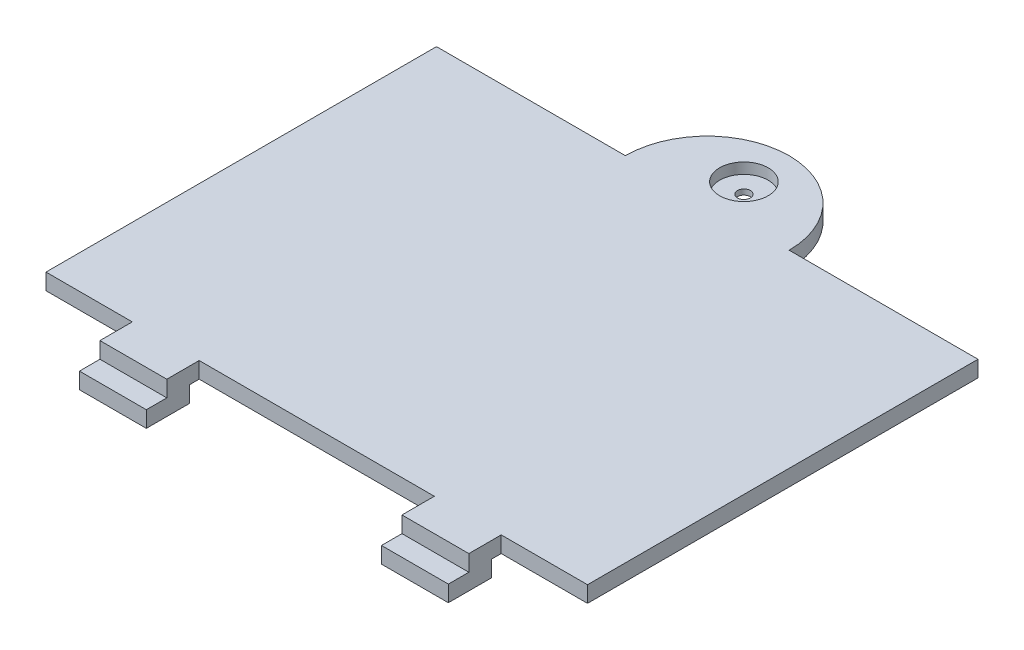
ISO-10303-21;
HEADER;
FILE_DESCRIPTION(('STEP AP214'),'2;1');
FILE_NAME('part.step','',(''),(''),'','','');
FILE_SCHEMA(('AUTOMOTIVE_DESIGN { 1 0 10303 214 1 1 1 1 }'));
ENDSEC;
DATA;
#1=APPLICATION_CONTEXT('core data for automotive mechanical design processes');
#2=APPLICATION_PROTOCOL_DEFINITION('international standard','automotive_design',2000,#1);
#3=PRODUCT_CONTEXT('',#1,'mechanical');
#4=PRODUCT('Part','Part','',(#3));
#5=PRODUCT_RELATED_PRODUCT_CATEGORY('part','',(#4));
#6=PRODUCT_DEFINITION_FORMATION('','',#4);
#7=PRODUCT_DEFINITION_CONTEXT('part definition',#1,'design');
#8=PRODUCT_DEFINITION('design','',#6,#7);
#9=PRODUCT_DEFINITION_SHAPE('','',#8);
#10=(LENGTH_UNIT() NAMED_UNIT(*) SI_UNIT(.MILLI.,.METRE.));
#11=(NAMED_UNIT(*) PLANE_ANGLE_UNIT() SI_UNIT($,.RADIAN.));
#12=(NAMED_UNIT(*) SI_UNIT($,.STERADIAN.) SOLID_ANGLE_UNIT());
#13=UNCERTAINTY_MEASURE_WITH_UNIT(LENGTH_MEASURE(1.E-05),#10,'distance_accuracy_value','');
#14=(GEOMETRIC_REPRESENTATION_CONTEXT(3) GLOBAL_UNCERTAINTY_ASSIGNED_CONTEXT((#13)) GLOBAL_UNIT_ASSIGNED_CONTEXT((#10,
#11,#12)) REPRESENTATION_CONTEXT('',''));
#15=CARTESIAN_POINT('',(0.,0.,0.));
#16=DIRECTION('',(0.,0.,1.));
#17=DIRECTION('',(1.,0.,0.));
#18=AXIS2_PLACEMENT_3D('',#15,#16,#17);
#19=CARTESIAN_POINT('',(0.,0.,0.));
#20=DIRECTION('',(0.,-1.,0.));
#21=DIRECTION('',(0.,0.,-1.));
#22=AXIS2_PLACEMENT_3D('',#19,#20,#21);
#23=PLANE('',#22);
#24=CARTESIAN_POINT('',(-25.1,0.,-3.4));
#25=DIRECTION('',(0.,-1.,0.));
#26=DIRECTION('',(0.,0.,-1.));
#27=AXIS2_PLACEMENT_3D('',#24,#25,#26);
#28=CIRCLE('',#27,0.6);
#29=CARTESIAN_POINT('',(-25.1,0.,-3.99999999999999));
#30=VERTEX_POINT('',#29);
#31=EDGE_CURVE('E46',#30,#30,#28,.T.);
#32=ORIENTED_EDGE('',*,*,#31,.F.);
#33=EDGE_LOOP('',(#32));
#34=FACE_BOUND('',#33,.T.);
#35=DIRECTION('',(0.,0.,-1.));
#36=VECTOR('',#35,1.);
#37=CARTESIAN_POINT('',(-7.99999999999999,0.,39.2));
#38=LINE('',#37,#36);
#39=CARTESIAN_POINT('',(-7.99999999999999,0.,37.1));
#40=VERTEX_POINT('',#39);
#41=CARTESIAN_POINT('',(-7.99999999999999,0.,36.2));
#42=VERTEX_POINT('',#41);
#43=EDGE_CURVE('E209',#40,#42,#38,.T.);
#44=ORIENTED_EDGE('',*,*,#43,.F.);
#45=DIRECTION('',(1.,0.,0.));
#46=VECTOR('',#45,1.);
#47=CARTESIAN_POINT('',(-7.99999999999999,0.,37.1));
#48=LINE('',#47,#46);
#49=CARTESIAN_POINT('',(-14.2,0.,37.1));
#50=VERTEX_POINT('',#49);
#51=EDGE_CURVE('E193',#50,#40,#48,.T.);
#52=ORIENTED_EDGE('',*,*,#51,.F.);
#53=DIRECTION('',(0.,0.,-1.));
#54=VECTOR('',#53,1.);
#55=CARTESIAN_POINT('',(-14.2,0.,39.2));
#56=LINE('',#55,#54);
#57=CARTESIAN_POINT('',(-14.2,0.,36.2));
#58=VERTEX_POINT('',#57);
#59=EDGE_CURVE('E219',#50,#58,#56,.T.);
#60=ORIENTED_EDGE('',*,*,#59,.T.);
#61=DIRECTION('',(1.,0.,0.));
#62=VECTOR('',#61,1.);
#63=CARTESIAN_POINT('',(0.,0.,36.2));
#64=LINE('',#63,#62);
#65=CARTESIAN_POINT('',(-36.,0.,36.2));
#66=VERTEX_POINT('',#65);
#67=EDGE_CURVE('E294',#66,#58,#64,.T.);
#68=ORIENTED_EDGE('',*,*,#67,.F.);
#69=DIRECTION('',(0.,0.,-1.));
#70=VECTOR('',#69,1.);
#71=CARTESIAN_POINT('',(-36.,0.,39.2));
#72=LINE('',#71,#70);
#73=CARTESIAN_POINT('',(-36.,0.,37.1));
#74=VERTEX_POINT('',#73);
#75=EDGE_CURVE('E265',#74,#66,#72,.T.);
#76=ORIENTED_EDGE('',*,*,#75,.F.);
#77=DIRECTION('',(1.,0.,0.));
#78=VECTOR('',#77,1.);
#79=CARTESIAN_POINT('',(-36.,0.,37.1));
#80=LINE('',#79,#78);
#81=CARTESIAN_POINT('',(-42.2,0.,37.1));
#82=VERTEX_POINT('',#81);
#83=EDGE_CURVE('E58',#82,#74,#80,.T.);
#84=ORIENTED_EDGE('',*,*,#83,.F.);
#85=DIRECTION('',(0.,0.,-1.));
#86=VECTOR('',#85,1.);
#87=CARTESIAN_POINT('',(-42.2,0.,39.2));
#88=LINE('',#87,#86);
#89=CARTESIAN_POINT('',(-42.2,0.,36.2));
#90=VERTEX_POINT('',#89);
#91=EDGE_CURVE('E267',#82,#90,#88,.T.);
#92=ORIENTED_EDGE('',*,*,#91,.T.);
#93=CARTESIAN_POINT('',(-50.2,0.,36.2));
#94=VERTEX_POINT('',#93);
#95=EDGE_CURVE('E273',#94,#90,#64,.T.);
#96=ORIENTED_EDGE('',*,*,#95,.F.);
#97=DIRECTION('',(0.,0.,1.));
#98=VECTOR('',#97,1.);
#99=CARTESIAN_POINT('',(-50.2,0.,0.));
#100=LINE('',#99,#98);
#101=CARTESIAN_POINT('',(-50.2,0.,0.));
#102=VERTEX_POINT('',#101);
#103=EDGE_CURVE('E290',#102,#94,#100,.T.);
#104=ORIENTED_EDGE('',*,*,#103,.F.);
#105=DIRECTION('',(-1.,0.,0.));
#106=VECTOR('',#105,1.);
#107=CARTESIAN_POINT('',(0.,0.,0.));
#108=LINE('',#107,#106);
#109=CARTESIAN_POINT('',(-32.69,0.,0.));
#110=VERTEX_POINT('',#109);
#111=EDGE_CURVE('E287',#110,#102,#108,.T.);
#112=ORIENTED_EDGE('',*,*,#111,.F.);
#113=CARTESIAN_POINT('',(-25.1,0.,0.));
#114=DIRECTION('',(0.,1.,0.));
#115=DIRECTION('',(0.,0.,1.));
#116=AXIS2_PLACEMENT_3D('',#113,#114,#115);
#117=CIRCLE('',#116,7.59);
#118=CARTESIAN_POINT('',(-17.51,0.,0.));
#119=VERTEX_POINT('',#118);
#120=EDGE_CURVE('E326',#110,#119,#117,.F.);
#121=ORIENTED_EDGE('',*,*,#120,.T.);
#122=CARTESIAN_POINT('',(0.,0.,0.));
#123=VERTEX_POINT('',#122);
#124=EDGE_CURVE('E288',#123,#119,#108,.T.);
#125=ORIENTED_EDGE('',*,*,#124,.F.);
#126=DIRECTION('',(0.,0.,-1.));
#127=VECTOR('',#126,1.);
#128=CARTESIAN_POINT('',(0.,0.,0.));
#129=LINE('',#128,#127);
#130=CARTESIAN_POINT('',(0.,0.,36.2));
#131=VERTEX_POINT('',#130);
#132=EDGE_CURVE('E269',#131,#123,#129,.T.);
#133=ORIENTED_EDGE('',*,*,#132,.F.);
#134=EDGE_CURVE('E216',#42,#131,#64,.T.);
#135=ORIENTED_EDGE('',*,*,#134,.F.);
#136=EDGE_LOOP('',(#44,#52,#60,#68,#76,#84,#92,#96,#104,#112,#121,#125,#133,#135));
#137=FACE_BOUND('',#136,.T.);
#138=ADVANCED_FACE('F42',(#34,#137),#23,.T.);
#139=CARTESIAN_POINT('',(0.,1.5,0.));
#140=DIRECTION('',(0.,0.,1.));
#141=DIRECTION('',(1.,0.,0.));
#142=AXIS2_PLACEMENT_3D('',#139,#140,#141);
#143=PLANE('',#142);
#144=DIRECTION('',(0.,1.,0.));
#145=VECTOR('',#144,1.);
#146=CARTESIAN_POINT('',(-17.51,0.,0.));
#147=LINE('',#146,#145);
#148=CARTESIAN_POINT('',(-17.51,1.5,0.));
#149=VERTEX_POINT('',#148);
#150=EDGE_CURVE('E224',#119,#149,#147,.T.);
#151=ORIENTED_EDGE('',*,*,#150,.T.);
#152=DIRECTION('',(-1.,0.,0.));
#153=VECTOR('',#152,1.);
#154=CARTESIAN_POINT('',(0.,1.5,0.));
#155=LINE('',#154,#153);
#156=CARTESIAN_POINT('',(0.,1.5,0.));
#157=VERTEX_POINT('',#156);
#158=EDGE_CURVE('E274',#157,#149,#155,.T.);
#159=ORIENTED_EDGE('',*,*,#158,.F.);
#160=DIRECTION('',(0.,-1.,0.));
#161=VECTOR('',#160,1.);
#162=CARTESIAN_POINT('',(0.,1.5,0.));
#163=LINE('',#162,#161);
#164=EDGE_CURVE('E11',#157,#123,#163,.T.);
#165=ORIENTED_EDGE('',*,*,#164,.T.);
#166=ORIENTED_EDGE('',*,*,#124,.T.);
#167=EDGE_LOOP('',(#151,#159,#165,#166));
#168=FACE_BOUND('',#167,.T.);
#169=ADVANCED_FACE('F341',(#168),#143,.F.);
#170=DIRECTION('',(0.,1.,0.));
#171=VECTOR('',#170,1.);
#172=CARTESIAN_POINT('',(-32.69,0.,0.));
#173=LINE('',#172,#171);
#174=CARTESIAN_POINT('',(-32.69,1.5,0.));
#175=VERTEX_POINT('',#174);
#176=EDGE_CURVE('E329',#110,#175,#173,.T.);
#177=ORIENTED_EDGE('',*,*,#176,.F.);
#178=ORIENTED_EDGE('',*,*,#111,.T.);
#179=DIRECTION('',(0.,-1.,0.));
#180=VECTOR('',#179,1.);
#181=CARTESIAN_POINT('',(-50.2,1.5,0.));
#182=LINE('',#181,#180);
#183=CARTESIAN_POINT('',(-50.2,1.5,0.));
#184=VERTEX_POINT('',#183);
#185=EDGE_CURVE('E51',#184,#102,#182,.T.);
#186=ORIENTED_EDGE('',*,*,#185,.F.);
#187=EDGE_CURVE('E66',#175,#184,#155,.T.);
#188=ORIENTED_EDGE('',*,*,#187,.F.);
#189=EDGE_LOOP('',(#177,#178,#186,#188));
#190=FACE_BOUND('',#189,.T.);
#191=ADVANCED_FACE('F338',(#190),#143,.F.);
#192=CARTESIAN_POINT('',(0.,1.5,36.2));
#193=DIRECTION('',(0.,0.,-1.));
#194=DIRECTION('',(-1.,0.,0.));
#195=AXIS2_PLACEMENT_3D('',#192,#193,#194);
#196=PLANE('',#195);
#197=DIRECTION('',(0.,-1.,0.));
#198=VECTOR('',#197,1.);
#199=CARTESIAN_POINT('',(-14.2,0.,36.2));
#200=LINE('',#199,#198);
#201=CARTESIAN_POINT('',(-14.2,1.5,36.2));
#202=VERTEX_POINT('',#201);
#203=EDGE_CURVE('E233',#202,#58,#200,.T.);
#204=ORIENTED_EDGE('',*,*,#203,.F.);
#205=DIRECTION('',(1.,0.,0.));
#206=VECTOR('',#205,1.);
#207=CARTESIAN_POINT('',(0.,1.5,36.2));
#208=LINE('',#207,#206);
#209=CARTESIAN_POINT('',(-36.,1.5,36.2));
#210=VERTEX_POINT('',#209);
#211=EDGE_CURVE('E284',#210,#202,#208,.T.);
#212=ORIENTED_EDGE('',*,*,#211,.F.);
#213=DIRECTION('',(0.,1.,0.));
#214=VECTOR('',#213,1.);
#215=CARTESIAN_POINT('',(-36.,0.,36.2));
#216=LINE('',#215,#214);
#217=EDGE_CURVE('E249',#66,#210,#216,.T.);
#218=ORIENTED_EDGE('',*,*,#217,.F.);
#219=ORIENTED_EDGE('',*,*,#67,.T.);
#220=EDGE_LOOP('',(#204,#212,#218,#219));
#221=FACE_BOUND('',#220,.T.);
#222=ADVANCED_FACE('F340',(#221),#196,.F.);
#223=DIRECTION('',(0.,1.,0.));
#224=VECTOR('',#223,1.);
#225=CARTESIAN_POINT('',(-7.99999999999999,0.,36.2));
#226=LINE('',#225,#224);
#227=CARTESIAN_POINT('',(-7.99999999999999,1.5,36.2));
#228=VERTEX_POINT('',#227);
#229=EDGE_CURVE('E231',#42,#228,#226,.T.);
#230=ORIENTED_EDGE('',*,*,#229,.F.);
#231=ORIENTED_EDGE('',*,*,#134,.T.);
#232=DIRECTION('',(0.,-1.,0.));
#233=VECTOR('',#232,1.);
#234=CARTESIAN_POINT('',(0.,1.5,36.2));
#235=LINE('',#234,#233);
#236=CARTESIAN_POINT('',(0.,1.5,36.2));
#237=VERTEX_POINT('',#236);
#238=EDGE_CURVE('E283',#237,#131,#235,.T.);
#239=ORIENTED_EDGE('',*,*,#238,.F.);
#240=EDGE_CURVE('E279',#228,#237,#208,.T.);
#241=ORIENTED_EDGE('',*,*,#240,.F.);
#242=EDGE_LOOP('',(#230,#231,#239,#241));
#243=FACE_BOUND('',#242,.T.);
#244=ADVANCED_FACE('F346',(#243),#196,.F.);
#245=DIRECTION('',(0.,-1.,0.));
#246=VECTOR('',#245,1.);
#247=CARTESIAN_POINT('',(-42.2,0.,36.2));
#248=LINE('',#247,#246);
#249=CARTESIAN_POINT('',(-42.2,1.5,36.2));
#250=VERTEX_POINT('',#249);
#251=EDGE_CURVE('E237',#250,#90,#248,.T.);
#252=ORIENTED_EDGE('',*,*,#251,.F.);
#253=CARTESIAN_POINT('',(-50.2,1.5,36.2));
#254=VERTEX_POINT('',#253);
#255=EDGE_CURVE('E280',#254,#250,#208,.T.);
#256=ORIENTED_EDGE('',*,*,#255,.F.);
#257=DIRECTION('',(0.,-1.,0.));
#258=VECTOR('',#257,1.);
#259=CARTESIAN_POINT('',(-50.2,1.5,36.2));
#260=LINE('',#259,#258);
#261=EDGE_CURVE('E297',#254,#94,#260,.T.);
#262=ORIENTED_EDGE('',*,*,#261,.T.);
#263=ORIENTED_EDGE('',*,*,#95,.T.);
#264=EDGE_LOOP('',(#252,#256,#262,#263));
#265=FACE_BOUND('',#264,.T.);
#266=ADVANCED_FACE('F309',(#265),#196,.F.);
#267=CARTESIAN_POINT('',(0.,1.5,0.));
#268=DIRECTION('',(-1.,0.,0.));
#269=DIRECTION('',(0.,0.,1.));
#270=AXIS2_PLACEMENT_3D('',#267,#268,#269);
#271=PLANE('',#270);
#272=ORIENTED_EDGE('',*,*,#132,.T.);
#273=ORIENTED_EDGE('',*,*,#164,.F.);
#274=DIRECTION('',(0.,0.,-1.));
#275=VECTOR('',#274,1.);
#276=CARTESIAN_POINT('',(0.,1.5,0.));
#277=LINE('',#276,#275);
#278=EDGE_CURVE('E270',#237,#157,#277,.T.);
#279=ORIENTED_EDGE('',*,*,#278,.F.);
#280=ORIENTED_EDGE('',*,*,#238,.T.);
#281=EDGE_LOOP('',(#272,#273,#279,#280));
#282=FACE_BOUND('',#281,.T.);
#283=ADVANCED_FACE('F44',(#282),#271,.F.);
#284=CARTESIAN_POINT('',(-50.2,1.5,0.));
#285=DIRECTION('',(1.,0.,0.));
#286=DIRECTION('',(0.,0.,-1.));
#287=AXIS2_PLACEMENT_3D('',#284,#285,#286);
#288=PLANE('',#287);
#289=ORIENTED_EDGE('',*,*,#103,.T.);
#290=ORIENTED_EDGE('',*,*,#261,.F.);
#291=DIRECTION('',(0.,0.,1.));
#292=VECTOR('',#291,1.);
#293=CARTESIAN_POINT('',(-50.2,1.5,0.));
#294=LINE('',#293,#292);
#295=EDGE_CURVE('E277',#184,#254,#294,.T.);
#296=ORIENTED_EDGE('',*,*,#295,.F.);
#297=ORIENTED_EDGE('',*,*,#185,.T.);
#298=EDGE_LOOP('',(#289,#290,#296,#297));
#299=FACE_BOUND('',#298,.T.);
#300=ADVANCED_FACE('F304',(#299),#288,.F.);
#301=CARTESIAN_POINT('',(0.,1.5,0.));
#302=DIRECTION('',(0.,-1.,0.));
#303=DIRECTION('',(0.,0.,-1.));
#304=AXIS2_PLACEMENT_3D('',#301,#302,#303);
#305=PLANE('',#304);
#306=CARTESIAN_POINT('',(-25.1,1.5,-3.4));
#307=DIRECTION('',(0.,1.,0.));
#308=DIRECTION('',(0.,0.,1.));
#309=AXIS2_PLACEMENT_3D('',#306,#307,#308);
#310=CIRCLE('',#309,2.25);
#311=CARTESIAN_POINT('',(-25.1,1.5,-1.15));
#312=VERTEX_POINT('',#311);
#313=EDGE_CURVE('E332',#312,#312,#310,.T.);
#314=ORIENTED_EDGE('',*,*,#313,.F.);
#315=EDGE_LOOP('',(#314));
#316=FACE_BOUND('',#315,.T.);
#317=ORIENTED_EDGE('',*,*,#278,.T.);
#318=ORIENTED_EDGE('',*,*,#158,.T.);
#319=CARTESIAN_POINT('',(-25.1,1.5,0.));
#320=DIRECTION('',(0.,1.,0.));
#321=DIRECTION('',(0.,0.,1.));
#322=AXIS2_PLACEMENT_3D('',#319,#320,#321);
#323=CIRCLE('',#322,7.59);
#324=EDGE_CURVE('E323',#175,#149,#323,.F.);
#325=ORIENTED_EDGE('',*,*,#324,.F.);
#326=ORIENTED_EDGE('',*,*,#187,.T.);
#327=ORIENTED_EDGE('',*,*,#295,.T.);
#328=ORIENTED_EDGE('',*,*,#255,.T.);
#329=DIRECTION('',(0.,0.,-1.));
#330=VECTOR('',#329,1.);
#331=CARTESIAN_POINT('',(-42.2,1.5,39.2));
#332=LINE('',#331,#330);
#333=CARTESIAN_POINT('',(-42.2,1.5,39.2));
#334=VERTEX_POINT('',#333);
#335=EDGE_CURVE('E255',#334,#250,#332,.T.);
#336=ORIENTED_EDGE('',*,*,#335,.F.);
#337=DIRECTION('',(-1.,0.,0.));
#338=VECTOR('',#337,1.);
#339=CARTESIAN_POINT('',(-42.2,1.5,39.2));
#340=LINE('',#339,#338);
#341=CARTESIAN_POINT('',(-36.,1.5,39.2));
#342=VERTEX_POINT('',#341);
#343=EDGE_CURVE('E253',#342,#334,#340,.T.);
#344=ORIENTED_EDGE('',*,*,#343,.F.);
#345=DIRECTION('',(0.,0.,-1.));
#346=VECTOR('',#345,1.);
#347=CARTESIAN_POINT('',(-36.,1.5,39.2));
#348=LINE('',#347,#346);
#349=EDGE_CURVE('E262',#342,#210,#348,.T.);
#350=ORIENTED_EDGE('',*,*,#349,.T.);
#351=ORIENTED_EDGE('',*,*,#211,.T.);
#352=DIRECTION('',(0.,0.,-1.));
#353=VECTOR('',#352,1.);
#354=CARTESIAN_POINT('',(-14.2,1.5,39.2));
#355=LINE('',#354,#353);
#356=CARTESIAN_POINT('',(-14.2,1.5,39.2));
#357=VERTEX_POINT('',#356);
#358=EDGE_CURVE('E222',#357,#202,#355,.T.);
#359=ORIENTED_EDGE('',*,*,#358,.F.);
#360=DIRECTION('',(-1.,0.,0.));
#361=VECTOR('',#360,1.);
#362=CARTESIAN_POINT('',(-14.2,1.5,39.2));
#363=LINE('',#362,#361);
#364=CARTESIAN_POINT('',(-7.99999999999999,1.5,39.2));
#365=VERTEX_POINT('',#364);
#366=EDGE_CURVE('E230',#365,#357,#363,.T.);
#367=ORIENTED_EDGE('',*,*,#366,.F.);
#368=DIRECTION('',(0.,0.,-1.));
#369=VECTOR('',#368,1.);
#370=CARTESIAN_POINT('',(-7.99999999999999,1.5,39.2));
#371=LINE('',#370,#369);
#372=EDGE_CURVE('E218',#365,#228,#371,.T.);
#373=ORIENTED_EDGE('',*,*,#372,.T.);
#374=ORIENTED_EDGE('',*,*,#240,.T.);
#375=EDGE_LOOP('',(#317,#318,#325,#326,#327,#328,#336,#344,#350,#351,#359,#367,#373,#374));
#376=FACE_BOUND('',#375,.T.);
#377=ADVANCED_FACE('F320',(#316,#376),#305,.F.);
#378=CARTESIAN_POINT('',(-42.2,0.,39.2));
#379=DIRECTION('',(1.,0.,0.));
#380=DIRECTION('',(0.,0.,-1.));
#381=AXIS2_PLACEMENT_3D('',#378,#379,#380);
#382=PLANE('',#381);
#383=ORIENTED_EDGE('',*,*,#251,.T.);
#384=ORIENTED_EDGE('',*,*,#91,.F.);
#385=DIRECTION('',(0.,1.,0.));
#386=VECTOR('',#385,1.);
#387=CARTESIAN_POINT('',(-42.2,-1.5,37.1));
#388=LINE('',#387,#386);
#389=CARTESIAN_POINT('',(-42.2,-1.5,37.1));
#390=VERTEX_POINT('',#389);
#391=EDGE_CURVE('E395',#390,#82,#388,.T.);
#392=ORIENTED_EDGE('',*,*,#391,.F.);
#393=DIRECTION('',(0.,0.,-1.));
#394=VECTOR('',#393,1.);
#395=CARTESIAN_POINT('',(-42.2,-1.5,37.1));
#396=LINE('',#395,#394);
#397=CARTESIAN_POINT('',(-42.2,-1.5,41.1));
#398=VERTEX_POINT('',#397);
#399=EDGE_CURVE('E799',#398,#390,#396,.T.);
#400=ORIENTED_EDGE('',*,*,#399,.F.);
#401=DIRECTION('',(0.,1.,0.));
#402=VECTOR('',#401,1.);
#403=CARTESIAN_POINT('',(-42.2,-1.5,41.1));
#404=LINE('',#403,#402);
#405=CARTESIAN_POINT('',(-42.2,0.,41.1));
#406=VERTEX_POINT('',#405);
#407=EDGE_CURVE('E409',#398,#406,#404,.T.);
#408=ORIENTED_EDGE('',*,*,#407,.T.);
#409=DIRECTION('',(0.,0.,-1.));
#410=VECTOR('',#409,1.);
#411=CARTESIAN_POINT('',(-42.2,0.,37.1));
#412=LINE('',#411,#410);
#413=CARTESIAN_POINT('',(-42.2,0.,39.2));
#414=VERTEX_POINT('',#413);
#415=EDGE_CURVE('E397',#406,#414,#412,.T.);
#416=ORIENTED_EDGE('',*,*,#415,.T.);
#417=DIRECTION('',(0.,-1.,0.));
#418=VECTOR('',#417,1.);
#419=CARTESIAN_POINT('',(-42.2,0.,39.2));
#420=LINE('',#419,#418);
#421=EDGE_CURVE('E246',#334,#414,#420,.T.);
#422=ORIENTED_EDGE('',*,*,#421,.F.);
#423=ORIENTED_EDGE('',*,*,#335,.T.);
#424=EDGE_LOOP('',(#383,#384,#392,#400,#408,#416,#422,#423));
#425=FACE_BOUND('',#424,.T.);
#426=ADVANCED_FACE('F312',(#425),#382,.F.);
#427=CARTESIAN_POINT('',(-36.,0.,39.2));
#428=DIRECTION('',(-1.,0.,0.));
#429=DIRECTION('',(0.,-1.,0.));
#430=AXIS2_PLACEMENT_3D('',#427,#428,#429);
#431=PLANE('',#430);
#432=ORIENTED_EDGE('',*,*,#217,.T.);
#433=ORIENTED_EDGE('',*,*,#349,.F.);
#434=DIRECTION('',(0.,1.,0.));
#435=VECTOR('',#434,1.);
#436=CARTESIAN_POINT('',(-36.,0.,39.2));
#437=LINE('',#436,#435);
#438=CARTESIAN_POINT('',(-36.,0.,39.2));
#439=VERTEX_POINT('',#438);
#440=EDGE_CURVE('E251',#439,#342,#437,.T.);
#441=ORIENTED_EDGE('',*,*,#440,.F.);
#442=DIRECTION('',(0.,0.,1.));
#443=VECTOR('',#442,1.);
#444=CARTESIAN_POINT('',(-36.,0.,37.1));
#445=LINE('',#444,#443);
#446=CARTESIAN_POINT('',(-36.,0.,41.1));
#447=VERTEX_POINT('',#446);
#448=EDGE_CURVE('E793',#439,#447,#445,.T.);
#449=ORIENTED_EDGE('',*,*,#448,.T.);
#450=DIRECTION('',(0.,1.,0.));
#451=VECTOR('',#450,1.);
#452=CARTESIAN_POINT('',(-36.,-1.5,41.1));
#453=LINE('',#452,#451);
#454=CARTESIAN_POINT('',(-36.,-1.5,41.1));
#455=VERTEX_POINT('',#454);
#456=EDGE_CURVE('E412',#455,#447,#453,.T.);
#457=ORIENTED_EDGE('',*,*,#456,.F.);
#458=DIRECTION('',(0.,0.,1.));
#459=VECTOR('',#458,1.);
#460=CARTESIAN_POINT('',(-36.,-1.5,37.1));
#461=LINE('',#460,#459);
#462=CARTESIAN_POINT('',(-36.,-1.5,37.1));
#463=VERTEX_POINT('',#462);
#464=EDGE_CURVE('E396',#463,#455,#461,.T.);
#465=ORIENTED_EDGE('',*,*,#464,.F.);
#466=DIRECTION('',(0.,1.,0.));
#467=VECTOR('',#466,1.);
#468=CARTESIAN_POINT('',(-36.,-1.5,37.1));
#469=LINE('',#468,#467);
#470=EDGE_CURVE('E391',#463,#74,#469,.T.);
#471=ORIENTED_EDGE('',*,*,#470,.T.);
#472=ORIENTED_EDGE('',*,*,#75,.T.);
#473=EDGE_LOOP('',(#432,#433,#441,#449,#457,#465,#471,#472));
#474=FACE_BOUND('',#473,.T.);
#475=ADVANCED_FACE('F386',(#474),#431,.F.);
#476=CARTESIAN_POINT('',(0.,0.,39.2));
#477=DIRECTION('',(0.,0.,-1.));
#478=DIRECTION('',(-1.,0.,0.));
#479=AXIS2_PLACEMENT_3D('',#476,#477,#478);
#480=PLANE('',#479);
#481=ORIENTED_EDGE('',*,*,#421,.T.);
#482=DIRECTION('',(1.,0.,0.));
#483=VECTOR('',#482,1.);
#484=CARTESIAN_POINT('',(-42.2,0.,39.2));
#485=LINE('',#484,#483);
#486=EDGE_CURVE('E248',#414,#439,#485,.T.);
#487=ORIENTED_EDGE('',*,*,#486,.T.);
#488=ORIENTED_EDGE('',*,*,#440,.T.);
#489=ORIENTED_EDGE('',*,*,#343,.T.);
#490=EDGE_LOOP('',(#481,#487,#488,#489));
#491=FACE_BOUND('',#490,.T.);
#492=ADVANCED_FACE('F446',(#491),#480,.F.);
#493=CARTESIAN_POINT('',(-14.2,0.,39.2));
#494=DIRECTION('',(1.,0.,0.));
#495=DIRECTION('',(0.,1.,0.));
#496=AXIS2_PLACEMENT_3D('',#493,#494,#495);
#497=PLANE('',#496);
#498=ORIENTED_EDGE('',*,*,#203,.T.);
#499=ORIENTED_EDGE('',*,*,#59,.F.);
#500=DIRECTION('',(0.,1.,0.));
#501=VECTOR('',#500,1.);
#502=CARTESIAN_POINT('',(-14.2,-1.5,37.1));
#503=LINE('',#502,#501);
#504=CARTESIAN_POINT('',(-14.2,-1.5,37.1));
#505=VERTEX_POINT('',#504);
#506=EDGE_CURVE('E200',#505,#50,#503,.T.);
#507=ORIENTED_EDGE('',*,*,#506,.F.);
#508=DIRECTION('',(0.,0.,-1.));
#509=VECTOR('',#508,1.);
#510=CARTESIAN_POINT('',(-14.2,-1.5,37.1));
#511=LINE('',#510,#509);
#512=CARTESIAN_POINT('',(-14.2,-1.5,41.1));
#513=VERTEX_POINT('',#512);
#514=EDGE_CURVE('E795',#513,#505,#511,.T.);
#515=ORIENTED_EDGE('',*,*,#514,.F.);
#516=DIRECTION('',(0.,1.,0.));
#517=VECTOR('',#516,1.);
#518=CARTESIAN_POINT('',(-14.2,-1.5,41.1));
#519=LINE('',#518,#517);
#520=CARTESIAN_POINT('',(-14.2,0.,41.1));
#521=VERTEX_POINT('',#520);
#522=EDGE_CURVE('E783',#513,#521,#519,.T.);
#523=ORIENTED_EDGE('',*,*,#522,.T.);
#524=DIRECTION('',(0.,0.,-1.));
#525=VECTOR('',#524,1.);
#526=CARTESIAN_POINT('',(-14.2,0.,37.1));
#527=LINE('',#526,#525);
#528=CARTESIAN_POINT('',(-14.2,0.,39.2));
#529=VERTEX_POINT('',#528);
#530=EDGE_CURVE('E203',#521,#529,#527,.T.);
#531=ORIENTED_EDGE('',*,*,#530,.T.);
#532=DIRECTION('',(0.,-1.,0.));
#533=VECTOR('',#532,1.);
#534=CARTESIAN_POINT('',(-14.2,0.,39.2));
#535=LINE('',#534,#533);
#536=EDGE_CURVE('E234',#357,#529,#535,.T.);
#537=ORIENTED_EDGE('',*,*,#536,.F.);
#538=ORIENTED_EDGE('',*,*,#358,.T.);
#539=EDGE_LOOP('',(#498,#499,#507,#515,#523,#531,#537,#538));
#540=FACE_BOUND('',#539,.T.);
#541=ADVANCED_FACE('F380',(#540),#497,.F.);
#542=CARTESIAN_POINT('',(-7.99999999999999,0.,39.2));
#543=DIRECTION('',(-1.,0.,0.));
#544=DIRECTION('',(0.,0.,1.));
#545=AXIS2_PLACEMENT_3D('',#542,#543,#544);
#546=PLANE('',#545);
#547=ORIENTED_EDGE('',*,*,#229,.T.);
#548=ORIENTED_EDGE('',*,*,#372,.F.);
#549=DIRECTION('',(0.,1.,0.));
#550=VECTOR('',#549,1.);
#551=CARTESIAN_POINT('',(-7.99999999999999,0.,39.2));
#552=LINE('',#551,#550);
#553=CARTESIAN_POINT('',(-7.99999999999999,0.,39.2));
#554=VERTEX_POINT('',#553);
#555=EDGE_CURVE('E239',#554,#365,#552,.T.);
#556=ORIENTED_EDGE('',*,*,#555,.F.);
#557=DIRECTION('',(0.,0.,1.));
#558=VECTOR('',#557,1.);
#559=CARTESIAN_POINT('',(-7.99999999999999,0.,37.1));
#560=LINE('',#559,#558);
#561=CARTESIAN_POINT('',(-7.99999999999999,0.,41.1));
#562=VERTEX_POINT('',#561);
#563=EDGE_CURVE('E781',#554,#562,#560,.T.);
#564=ORIENTED_EDGE('',*,*,#563,.T.);
#565=DIRECTION('',(0.,1.,0.));
#566=VECTOR('',#565,1.);
#567=CARTESIAN_POINT('',(-7.99999999999999,-1.5,41.1));
#568=LINE('',#567,#566);
#569=CARTESIAN_POINT('',(-7.99999999999999,-1.5,41.1));
#570=VERTEX_POINT('',#569);
#571=EDGE_CURVE('E779',#570,#562,#568,.T.);
#572=ORIENTED_EDGE('',*,*,#571,.F.);
#573=DIRECTION('',(0.,0.,1.));
#574=VECTOR('',#573,1.);
#575=CARTESIAN_POINT('',(-7.99999999999999,-1.5,37.1));
#576=LINE('',#575,#574);
#577=CARTESIAN_POINT('',(-7.99999999999999,-1.5,37.1));
#578=VERTEX_POINT('',#577);
#579=EDGE_CURVE('E204',#578,#570,#576,.T.);
#580=ORIENTED_EDGE('',*,*,#579,.F.);
#581=DIRECTION('',(0.,1.,0.));
#582=VECTOR('',#581,1.);
#583=CARTESIAN_POINT('',(-7.99999999999999,-1.5,37.1));
#584=LINE('',#583,#582);
#585=EDGE_CURVE('E197',#578,#40,#584,.T.);
#586=ORIENTED_EDGE('',*,*,#585,.T.);
#587=ORIENTED_EDGE('',*,*,#43,.T.);
#588=EDGE_LOOP('',(#547,#548,#556,#564,#572,#580,#586,#587));
#589=FACE_BOUND('',#588,.T.);
#590=ADVANCED_FACE('F208',(#589),#546,.F.);
#591=CARTESIAN_POINT('',(0.,0.,39.2));
#592=DIRECTION('',(0.,0.,-1.));
#593=DIRECTION('',(-1.,0.,0.));
#594=AXIS2_PLACEMENT_3D('',#591,#592,#593);
#595=PLANE('',#594);
#596=ORIENTED_EDGE('',*,*,#536,.T.);
#597=DIRECTION('',(1.,0.,0.));
#598=VECTOR('',#597,1.);
#599=CARTESIAN_POINT('',(-14.2,0.,39.2));
#600=LINE('',#599,#598);
#601=EDGE_CURVE('E241',#529,#554,#600,.T.);
#602=ORIENTED_EDGE('',*,*,#601,.T.);
#603=ORIENTED_EDGE('',*,*,#555,.T.);
#604=ORIENTED_EDGE('',*,*,#366,.T.);
#605=EDGE_LOOP('',(#596,#602,#603,#604));
#606=FACE_BOUND('',#605,.T.);
#607=ADVANCED_FACE('F441',(#606),#595,.F.);
#608=CARTESIAN_POINT('',(-25.1,0.,0.));
#609=DIRECTION('',(0.,1.,0.));
#610=DIRECTION('',(0.,0.,1.));
#611=AXIS2_PLACEMENT_3D('',#608,#609,#610);
#612=CYLINDRICAL_SURFACE('',#611,7.59);
#613=ORIENTED_EDGE('',*,*,#324,.T.);
#614=ORIENTED_EDGE('',*,*,#150,.F.);
#615=ORIENTED_EDGE('',*,*,#120,.F.);
#616=ORIENTED_EDGE('',*,*,#176,.T.);
#617=EDGE_LOOP('',(#613,#614,#615,#616));
#618=FACE_BOUND('',#617,.T.);
#619=ADVANCED_FACE('F337',(#618),#612,.T.);
#620=CARTESIAN_POINT('',(-25.1,0.5,-3.4));
#621=DIRECTION('',(0.,1.,0.));
#622=DIRECTION('',(0.,0.,1.));
#623=AXIS2_PLACEMENT_3D('',#620,#621,#622);
#624=CYLINDRICAL_SURFACE('',#623,2.25);
#625=CARTESIAN_POINT('',(-25.1,0.5,-3.4));
#626=DIRECTION('',(0.,1.,0.));
#627=DIRECTION('',(0.,0.,1.));
#628=AXIS2_PLACEMENT_3D('',#625,#626,#627);
#629=CIRCLE('',#628,2.25);
#630=CARTESIAN_POINT('',(-25.1,0.5,-1.15));
#631=VERTEX_POINT('',#630);
#632=EDGE_CURVE('E327',#631,#631,#629,.T.);
#633=ORIENTED_EDGE('',*,*,#632,.F.);
#634=EDGE_LOOP('',(#633));
#635=FACE_BOUND('',#634,.T.);
#636=ORIENTED_EDGE('',*,*,#313,.T.);
#637=EDGE_LOOP('',(#636));
#638=FACE_BOUND('',#637,.T.);
#639=ADVANCED_FACE('F432',(#635,#638),#624,.F.);
#640=CARTESIAN_POINT('',(-25.1,0.5,-3.4));
#641=DIRECTION('',(0.,1.,0.));
#642=DIRECTION('',(0.,0.,1.));
#643=AXIS2_PLACEMENT_3D('',#640,#641,#642);
#644=PLANE('',#643);
#645=CARTESIAN_POINT('',(-25.1,0.5,-3.4));
#646=DIRECTION('',(0.,1.,0.));
#647=DIRECTION('',(0.,0.,1.));
#648=AXIS2_PLACEMENT_3D('',#645,#646,#647);
#649=CIRCLE('',#648,0.6);
#650=CARTESIAN_POINT('',(-25.1,0.5,-2.79999999999999));
#651=VERTEX_POINT('',#650);
#652=EDGE_CURVE('E415',#651,#651,#649,.T.);
#653=ORIENTED_EDGE('',*,*,#652,.F.);
#654=EDGE_LOOP('',(#653));
#655=FACE_BOUND('',#654,.T.);
#656=ORIENTED_EDGE('',*,*,#632,.T.);
#657=EDGE_LOOP('',(#656));
#658=FACE_BOUND('',#657,.T.);
#659=ADVANCED_FACE('F426',(#655,#658),#644,.T.);
#660=CARTESIAN_POINT('',(-25.1,-0.5,-3.4));
#661=DIRECTION('',(0.,1.,0.));
#662=DIRECTION('',(0.,0.,1.));
#663=AXIS2_PLACEMENT_3D('',#660,#661,#662);
#664=CYLINDRICAL_SURFACE('',#663,0.6);
#665=ORIENTED_EDGE('',*,*,#31,.T.);
#666=EDGE_LOOP('',(#665));
#667=FACE_BOUND('',#666,.T.);
#668=ORIENTED_EDGE('',*,*,#652,.T.);
#669=EDGE_LOOP('',(#668));
#670=FACE_BOUND('',#669,.T.);
#671=ADVANCED_FACE('F422',(#667,#670),#664,.F.);
#672=CARTESIAN_POINT('',(-36.,-1.5,41.1));
#673=DIRECTION('',(0.,0.,-1.));
#674=DIRECTION('',(-1.,0.,0.));
#675=AXIS2_PLACEMENT_3D('',#672,#673,#674);
#676=PLANE('',#675);
#677=DIRECTION('',(-1.,0.,0.));
#678=VECTOR('',#677,1.);
#679=CARTESIAN_POINT('',(-36.,0.,41.1));
#680=LINE('',#679,#678);
#681=EDGE_CURVE('E402',#447,#406,#680,.T.);
#682=ORIENTED_EDGE('',*,*,#681,.T.);
#683=ORIENTED_EDGE('',*,*,#407,.F.);
#684=DIRECTION('',(-1.,0.,0.));
#685=VECTOR('',#684,1.);
#686=CARTESIAN_POINT('',(-36.,-1.5,41.1));
#687=LINE('',#686,#685);
#688=EDGE_CURVE('E400',#455,#398,#687,.T.);
#689=ORIENTED_EDGE('',*,*,#688,.F.);
#690=ORIENTED_EDGE('',*,*,#456,.T.);
#691=EDGE_LOOP('',(#682,#683,#689,#690));
#692=FACE_BOUND('',#691,.T.);
#693=ADVANCED_FACE('F425',(#692),#676,.F.);
#694=CARTESIAN_POINT('',(-36.,-1.5,37.1));
#695=DIRECTION('',(0.,0.,1.));
#696=DIRECTION('',(1.,0.,0.));
#697=AXIS2_PLACEMENT_3D('',#694,#695,#696);
#698=PLANE('',#697);
#699=ORIENTED_EDGE('',*,*,#83,.T.);
#700=ORIENTED_EDGE('',*,*,#470,.F.);
#701=DIRECTION('',(1.,0.,0.));
#702=VECTOR('',#701,1.);
#703=CARTESIAN_POINT('',(-36.,-1.5,37.1));
#704=LINE('',#703,#702);
#705=EDGE_CURVE('E407',#390,#463,#704,.T.);
#706=ORIENTED_EDGE('',*,*,#705,.F.);
#707=ORIENTED_EDGE('',*,*,#391,.T.);
#708=EDGE_LOOP('',(#699,#700,#706,#707));
#709=FACE_BOUND('',#708,.T.);
#710=ADVANCED_FACE('F393',(#709),#698,.F.);
#711=CARTESIAN_POINT('',(0.,-1.5,0.));
#712=DIRECTION('',(0.,-1.,0.));
#713=DIRECTION('',(0.,0.,-1.));
#714=AXIS2_PLACEMENT_3D('',#711,#712,#713);
#715=PLANE('',#714);
#716=ORIENTED_EDGE('',*,*,#464,.T.);
#717=ORIENTED_EDGE('',*,*,#688,.T.);
#718=ORIENTED_EDGE('',*,*,#399,.T.);
#719=ORIENTED_EDGE('',*,*,#705,.T.);
#720=EDGE_LOOP('',(#716,#717,#718,#719));
#721=FACE_BOUND('',#720,.T.);
#722=ADVANCED_FACE('F522',(#721),#715,.T.);
#723=CARTESIAN_POINT('',(0.,0.,0.));
#724=DIRECTION('',(0.,-1.,0.));
#725=DIRECTION('',(0.,0.,-1.));
#726=AXIS2_PLACEMENT_3D('',#723,#724,#725);
#727=PLANE('',#726);
#728=ORIENTED_EDGE('',*,*,#486,.F.);
#729=ORIENTED_EDGE('',*,*,#415,.F.);
#730=ORIENTED_EDGE('',*,*,#681,.F.);
#731=ORIENTED_EDGE('',*,*,#448,.F.);
#732=EDGE_LOOP('',(#728,#729,#730,#731));
#733=FACE_BOUND('',#732,.T.);
#734=ADVANCED_FACE('F531',(#733),#727,.F.);
#735=CARTESIAN_POINT('',(0.,0.,0.));
#736=DIRECTION('',(0.,-1.,0.));
#737=DIRECTION('',(0.,0.,-1.));
#738=AXIS2_PLACEMENT_3D('',#735,#736,#737);
#739=PLANE('',#738);
#740=ORIENTED_EDGE('',*,*,#563,.F.);
#741=ORIENTED_EDGE('',*,*,#601,.F.);
#742=ORIENTED_EDGE('',*,*,#530,.F.);
#743=DIRECTION('',(-1.,0.,0.));
#744=VECTOR('',#743,1.);
#745=CARTESIAN_POINT('',(-7.99999999999999,0.,41.1));
#746=LINE('',#745,#744);
#747=EDGE_CURVE('E790',#562,#521,#746,.T.);
#748=ORIENTED_EDGE('',*,*,#747,.F.);
#749=EDGE_LOOP('',(#740,#741,#742,#748));
#750=FACE_BOUND('',#749,.T.);
#751=ADVANCED_FACE('F541',(#750),#739,.F.);
#752=CARTESIAN_POINT('',(-7.99999999999999,-1.5,41.1));
#753=DIRECTION('',(0.,0.,-1.));
#754=DIRECTION('',(-1.,0.,0.));
#755=AXIS2_PLACEMENT_3D('',#752,#753,#754);
#756=PLANE('',#755);
#757=ORIENTED_EDGE('',*,*,#747,.T.);
#758=ORIENTED_EDGE('',*,*,#522,.F.);
#759=DIRECTION('',(-1.,0.,0.));
#760=VECTOR('',#759,1.);
#761=CARTESIAN_POINT('',(-7.99999999999999,-1.5,41.1));
#762=LINE('',#761,#760);
#763=EDGE_CURVE('E775',#570,#513,#762,.T.);
#764=ORIENTED_EDGE('',*,*,#763,.F.);
#765=ORIENTED_EDGE('',*,*,#571,.T.);
#766=EDGE_LOOP('',(#757,#758,#764,#765));
#767=FACE_BOUND('',#766,.T.);
#768=ADVANCED_FACE('F551',(#767),#756,.F.);
#769=CARTESIAN_POINT('',(-7.99999999999999,-1.5,37.1));
#770=DIRECTION('',(0.,0.,1.));
#771=DIRECTION('',(1.,0.,0.));
#772=AXIS2_PLACEMENT_3D('',#769,#770,#771);
#773=PLANE('',#772);
#774=ORIENTED_EDGE('',*,*,#51,.T.);
#775=ORIENTED_EDGE('',*,*,#585,.F.);
#776=DIRECTION('',(1.,0.,0.));
#777=VECTOR('',#776,1.);
#778=CARTESIAN_POINT('',(-7.99999999999999,-1.5,37.1));
#779=LINE('',#778,#777);
#780=EDGE_CURVE('E213',#505,#578,#779,.T.);
#781=ORIENTED_EDGE('',*,*,#780,.F.);
#782=ORIENTED_EDGE('',*,*,#506,.T.);
#783=EDGE_LOOP('',(#774,#775,#781,#782));
#784=FACE_BOUND('',#783,.T.);
#785=ADVANCED_FACE('F195',(#784),#773,.F.);
#786=CARTESIAN_POINT('',(0.,-1.5,0.));
#787=DIRECTION('',(0.,-1.,0.));
#788=DIRECTION('',(0.,0.,-1.));
#789=AXIS2_PLACEMENT_3D('',#786,#787,#788);
#790=PLANE('',#789);
#791=ORIENTED_EDGE('',*,*,#579,.T.);
#792=ORIENTED_EDGE('',*,*,#763,.T.);
#793=ORIENTED_EDGE('',*,*,#514,.T.);
#794=ORIENTED_EDGE('',*,*,#780,.T.);
#795=EDGE_LOOP('',(#791,#792,#793,#794));
#796=FACE_BOUND('',#795,.T.);
#797=ADVANCED_FACE('F570',(#796),#790,.T.);
#798=CLOSED_SHELL('',(#138,#169,#191,#222,#244,#266,#283,#300,#377,#426,#475,#492,#541,#590,
#607,#619,#639,#659,#671,#693,#710,#722,#734,#751,#768,#785,#797));
#799=MANIFOLD_SOLID_BREP('B2',#798);
#800=ADVANCED_BREP_SHAPE_REPRESENTATION('',(#18,#799),#14);
#801=SHAPE_DEFINITION_REPRESENTATION(#9,#800);
ENDSEC;
END-ISO-10303-21;
